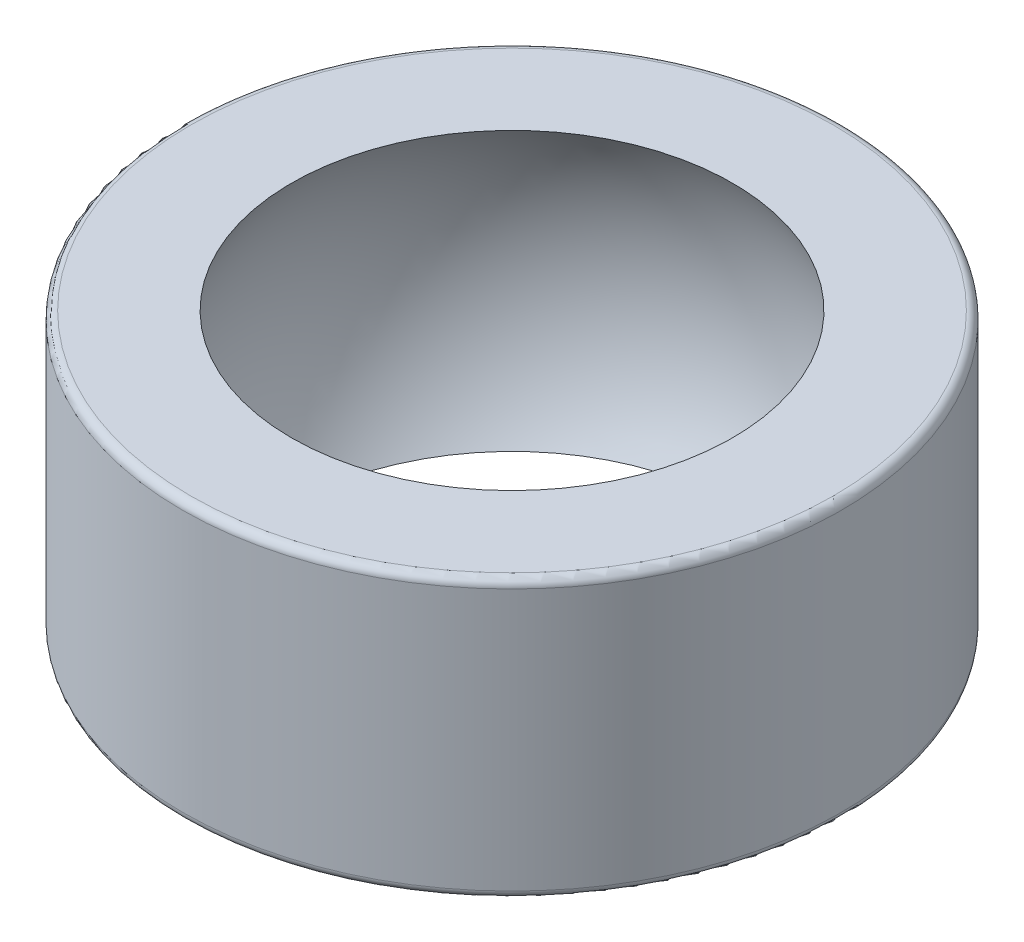
ISO-10303-21;
HEADER;
FILE_DESCRIPTION(('STEP AP214'),'2;1');
FILE_NAME('part.step','',(''),(''),'','','');
FILE_SCHEMA(('AUTOMOTIVE_DESIGN { 1 0 10303 214 1 1 1 1 }'));
ENDSEC;
DATA;
#1=APPLICATION_CONTEXT('core data for automotive mechanical design processes');
#2=APPLICATION_PROTOCOL_DEFINITION('international standard','automotive_design',2000,#1);
#3=PRODUCT_CONTEXT('',#1,'mechanical');
#4=PRODUCT('Part','Part','',(#3));
#5=PRODUCT_RELATED_PRODUCT_CATEGORY('part','',(#4));
#6=PRODUCT_DEFINITION_FORMATION('','',#4);
#7=PRODUCT_DEFINITION_CONTEXT('part definition',#1,'design');
#8=PRODUCT_DEFINITION('design','',#6,#7);
#9=PRODUCT_DEFINITION_SHAPE('','',#8);
#10=(LENGTH_UNIT() NAMED_UNIT(*) SI_UNIT(.MILLI.,.METRE.));
#11=(NAMED_UNIT(*) PLANE_ANGLE_UNIT() SI_UNIT($,.RADIAN.));
#12=(NAMED_UNIT(*) SI_UNIT($,.STERADIAN.) SOLID_ANGLE_UNIT());
#13=UNCERTAINTY_MEASURE_WITH_UNIT(LENGTH_MEASURE(1.E-05),#10,'distance_accuracy_value','');
#14=(GEOMETRIC_REPRESENTATION_CONTEXT(3) GLOBAL_UNCERTAINTY_ASSIGNED_CONTEXT((#13)) GLOBAL_UNIT_ASSIGNED_CONTEXT((#10,
#11,#12)) REPRESENTATION_CONTEXT('',''));
#15=CARTESIAN_POINT('',(0.,0.,0.));
#16=DIRECTION('',(0.,0.,1.));
#17=DIRECTION('',(1.,0.,0.));
#18=AXIS2_PLACEMENT_3D('',#15,#16,#17);
#19=CARTESIAN_POINT('',(0.,3.375,0.));
#20=DIRECTION('',(0.,-1.,0.));
#21=DIRECTION('',(0.,0.,-1.));
#22=AXIS2_PLACEMENT_3D('',#19,#20,#21);
#23=CYLINDRICAL_SURFACE('',#22,8.);
#24=CARTESIAN_POINT('',(0.,-3.175,0.));
#25=DIRECTION('',(0.,1.,0.));
#26=DIRECTION('',(0.,0.,1.));
#27=AXIS2_PLACEMENT_3D('',#24,#25,#26);
#28=CIRCLE('',#27,8.);
#29=CARTESIAN_POINT('',(0.,-3.175,8.));
#30=VERTEX_POINT('',#29);
#31=EDGE_CURVE('E42',#30,#30,#28,.T.);
#32=ORIENTED_EDGE('',*,*,#31,.T.);
#33=EDGE_LOOP('',(#32));
#34=FACE_BOUND('',#33,.T.);
#35=CARTESIAN_POINT('',(0.,3.175,0.));
#36=DIRECTION('',(0.,1.,0.));
#37=DIRECTION('',(0.,0.,1.));
#38=AXIS2_PLACEMENT_3D('',#35,#36,#37);
#39=CIRCLE('',#38,8.);
#40=CARTESIAN_POINT('',(0.,3.175,8.));
#41=VERTEX_POINT('',#40);
#42=EDGE_CURVE('E46',#41,#41,#39,.F.);
#43=ORIENTED_EDGE('',*,*,#42,.T.);
#44=EDGE_LOOP('',(#43));
#45=FACE_BOUND('',#44,.T.);
#46=ADVANCED_FACE('F31',(#34,#45),#23,.T.);
#47=CARTESIAN_POINT('',(0.,3.375,0.));
#48=DIRECTION('',(0.,1.,0.));
#49=DIRECTION('',(0.,0.,1.));
#50=AXIS2_PLACEMENT_3D('',#47,#48,#49);
#51=PLANE('',#50);
#52=CARTESIAN_POINT('',(0.,3.375,0.));
#53=DIRECTION('',(0.,1.,0.));
#54=DIRECTION('',(0.,0.,1.));
#55=AXIS2_PLACEMENT_3D('',#52,#53,#54);
#56=CIRCLE('',#55,7.8);
#57=CARTESIAN_POINT('',(0.,3.375,7.8));
#58=VERTEX_POINT('',#57);
#59=EDGE_CURVE('E10',#58,#58,#56,.T.);
#60=ORIENTED_EDGE('',*,*,#59,.T.);
#61=EDGE_LOOP('',(#60));
#62=FACE_BOUND('',#61,.T.);
#63=CARTESIAN_POINT('',(0.,3.375,0.));
#64=DIRECTION('',(0.,1.,0.));
#65=DIRECTION('',(0.,0.,1.));
#66=AXIS2_PLACEMENT_3D('',#63,#64,#65);
#67=CIRCLE('',#66,5.35521007991283);
#68=CARTESIAN_POINT('',(0.,3.375,5.35521007991283));
#69=VERTEX_POINT('',#68);
#70=EDGE_CURVE('E51',#69,#69,#67,.T.);
#71=ORIENTED_EDGE('',*,*,#70,.F.);
#72=EDGE_LOOP('',(#71));
#73=FACE_BOUND('',#72,.T.);
#74=ADVANCED_FACE('F61',(#62,#73),#51,.T.);
#75=CARTESIAN_POINT('',(0.,-3.375,0.));
#76=DIRECTION('',(0.,1.,0.));
#77=DIRECTION('',(0.,0.,1.));
#78=AXIS2_PLACEMENT_3D('',#75,#76,#77);
#79=PLANE('',#78);
#80=CARTESIAN_POINT('',(0.,-3.375,0.));
#81=DIRECTION('',(0.,1.,0.));
#82=DIRECTION('',(0.,0.,1.));
#83=AXIS2_PLACEMENT_3D('',#80,#81,#82);
#84=CIRCLE('',#83,7.8);
#85=CARTESIAN_POINT('',(0.,-3.375,7.8));
#86=VERTEX_POINT('',#85);
#87=EDGE_CURVE('E38',#86,#86,#84,.F.);
#88=ORIENTED_EDGE('',*,*,#87,.T.);
#89=EDGE_LOOP('',(#88));
#90=FACE_BOUND('',#89,.T.);
#91=CARTESIAN_POINT('',(0.,-3.375,0.));
#92=DIRECTION('',(0.,1.,0.));
#93=DIRECTION('',(0.,0.,1.));
#94=AXIS2_PLACEMENT_3D('',#91,#92,#93);
#95=CIRCLE('',#94,5.35521007991283);
#96=CARTESIAN_POINT('',(0.,-3.375,5.35521007991283));
#97=VERTEX_POINT('',#96);
#98=EDGE_CURVE('E52',#97,#97,#95,.T.);
#99=ORIENTED_EDGE('',*,*,#98,.T.);
#100=EDGE_LOOP('',(#99));
#101=FACE_BOUND('',#100,.T.);
#102=ADVANCED_FACE('F63',(#90,#101),#79,.F.);
#103=CARTESIAN_POINT('',(0.,0.,0.));
#104=DIRECTION('',(0.,-1.,0.));
#105=DIRECTION('',(-1.,0.,0.));
#106=AXIS2_PLACEMENT_3D('',#103,#104,#105);
#107=SPHERICAL_SURFACE('',#106,6.33);
#108=ORIENTED_EDGE('',*,*,#70,.T.);
#109=EDGE_LOOP('',(#108));
#110=FACE_BOUND('',#109,.T.);
#111=ORIENTED_EDGE('',*,*,#98,.F.);
#112=EDGE_LOOP('',(#111));
#113=FACE_BOUND('',#112,.T.);
#114=ADVANCED_FACE('F58',(#110,#113),#107,.F.);
#115=CARTESIAN_POINT('',(0.,-3.175,0.));
#116=DIRECTION('',(0.,1.,0.));
#117=DIRECTION('',(0.,0.,1.));
#118=AXIS2_PLACEMENT_3D('',#115,#116,#117);
#119=TOROIDAL_SURFACE('',#118,7.8,0.2);
#120=ORIENTED_EDGE('',*,*,#87,.F.);
#121=EDGE_LOOP('',(#120));
#122=FACE_BOUND('',#121,.T.);
#123=ORIENTED_EDGE('',*,*,#31,.F.);
#124=EDGE_LOOP('',(#123));
#125=FACE_BOUND('',#124,.T.);
#126=ADVANCED_FACE('F73',(#122,#125),#119,.T.);
#127=CARTESIAN_POINT('',(0.,3.175,0.));
#128=DIRECTION('',(0.,1.,0.));
#129=DIRECTION('',(0.,0.,1.));
#130=AXIS2_PLACEMENT_3D('',#127,#128,#129);
#131=TOROIDAL_SURFACE('',#130,7.8,0.2);
#132=ORIENTED_EDGE('',*,*,#42,.F.);
#133=EDGE_LOOP('',(#132));
#134=FACE_BOUND('',#133,.T.);
#135=ORIENTED_EDGE('',*,*,#59,.F.);
#136=EDGE_LOOP('',(#135));
#137=FACE_BOUND('',#136,.T.);
#138=ADVANCED_FACE('F33',(#134,#137),#131,.T.);
#139=CLOSED_SHELL('',(#46,#74,#102,#114,#126,#138));
#140=MANIFOLD_SOLID_BREP('B2',#139);
#141=ADVANCED_BREP_SHAPE_REPRESENTATION('',(#18,#140),#14);
#142=SHAPE_DEFINITION_REPRESENTATION(#9,#141);
ENDSEC;
END-ISO-10303-21;
